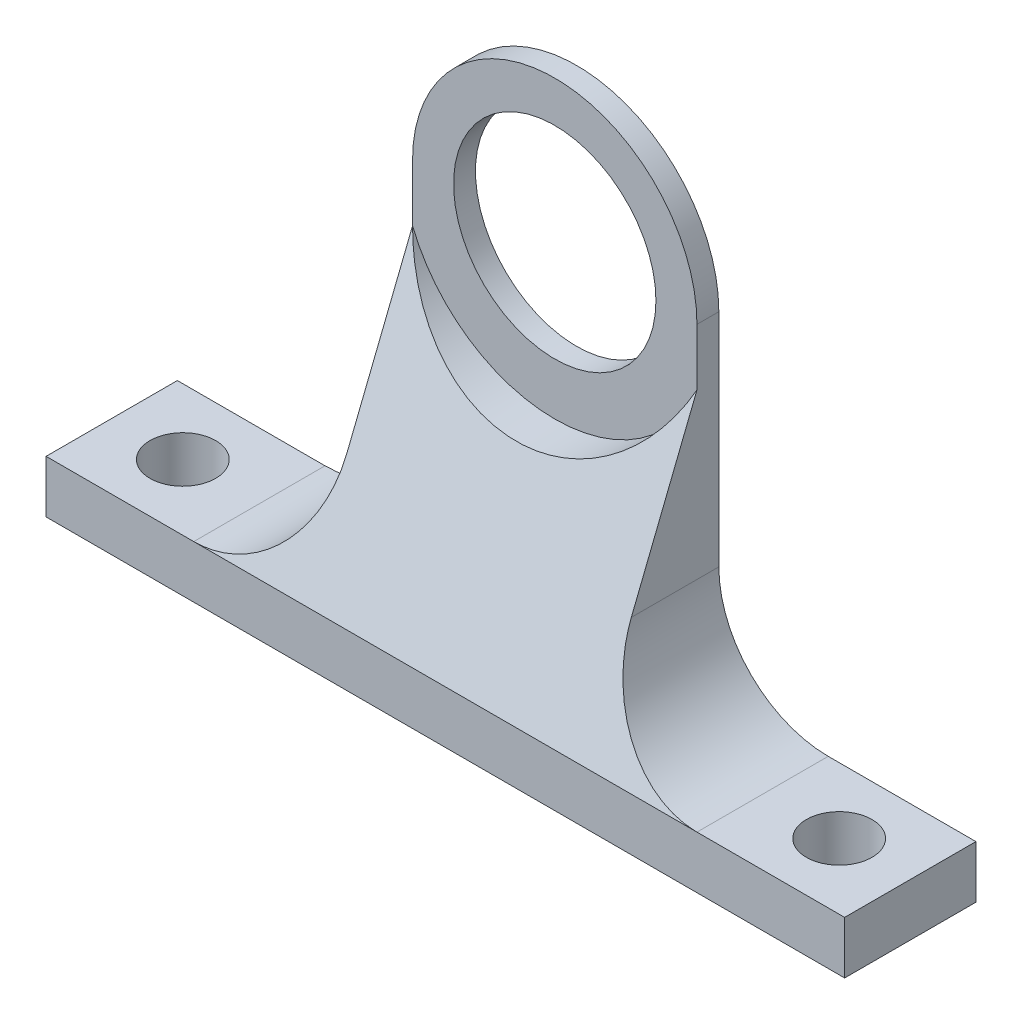
ISO-10303-21;
HEADER;
FILE_DESCRIPTION(('STEP AP214'),'2;1');
FILE_NAME('part.step','',(''),(''),'','','');
FILE_SCHEMA(('AUTOMOTIVE_DESIGN { 1 0 10303 214 1 1 1 1 }'));
ENDSEC;
DATA;
#1=APPLICATION_CONTEXT('core data for automotive mechanical design processes');
#2=APPLICATION_PROTOCOL_DEFINITION('international standard','automotive_design',2000,#1);
#3=PRODUCT_CONTEXT('',#1,'mechanical');
#4=PRODUCT('Part','Part','',(#3));
#5=PRODUCT_RELATED_PRODUCT_CATEGORY('part','',(#4));
#6=PRODUCT_DEFINITION_FORMATION('','',#4);
#7=PRODUCT_DEFINITION_CONTEXT('part definition',#1,'design');
#8=PRODUCT_DEFINITION('design','',#6,#7);
#9=PRODUCT_DEFINITION_SHAPE('','',#8);
#10=(LENGTH_UNIT() NAMED_UNIT(*) SI_UNIT(.MILLI.,.METRE.));
#11=(NAMED_UNIT(*) PLANE_ANGLE_UNIT() SI_UNIT($,.RADIAN.));
#12=(NAMED_UNIT(*) SI_UNIT($,.STERADIAN.) SOLID_ANGLE_UNIT());
#13=UNCERTAINTY_MEASURE_WITH_UNIT(LENGTH_MEASURE(1.E-05),#10,'distance_accuracy_value','');
#14=(GEOMETRIC_REPRESENTATION_CONTEXT(3) GLOBAL_UNCERTAINTY_ASSIGNED_CONTEXT((#13)) GLOBAL_UNIT_ASSIGNED_CONTEXT((#10,
#11,#12)) REPRESENTATION_CONTEXT('',''));
#15=CARTESIAN_POINT('',(0.,0.,0.));
#16=DIRECTION('',(0.,0.,1.));
#17=DIRECTION('',(1.,0.,0.));
#18=AXIS2_PLACEMENT_3D('',#15,#16,#17);
#19=CARTESIAN_POINT('',(0.,35.,12.));
#20=DIRECTION('',(0.,0.,-1.));
#21=DIRECTION('',(-1.,0.,0.));
#22=AXIS2_PLACEMENT_3D('',#19,#20,#21);
#23=CYLINDRICAL_SURFACE('',#22,13.);
#24=CARTESIAN_POINT('',(0.,35.,2.));
#25=DIRECTION('',(0.,0.,1.));
#26=DIRECTION('',(1.,0.,0.));
#27=AXIS2_PLACEMENT_3D('',#24,#25,#26);
#28=CIRCLE('',#27,13.);
#29=CARTESIAN_POINT('',(13.,35.,2.));
#30=VERTEX_POINT('',#29);
#31=CARTESIAN_POINT('',(-13.,35.,2.));
#32=VERTEX_POINT('',#31);
#33=EDGE_CURVE('E50',#30,#32,#28,.T.);
#34=ORIENTED_EDGE('',*,*,#33,.F.);
#35=DIRECTION('',(0.,0.,-1.));
#36=VECTOR('',#35,1.);
#37=CARTESIAN_POINT('',(13.,35.,12.));
#38=LINE('',#37,#36);
#39=CARTESIAN_POINT('',(13.,35.,0.));
#40=VERTEX_POINT('',#39);
#41=EDGE_CURVE('E217',#30,#40,#38,.T.);
#42=ORIENTED_EDGE('',*,*,#41,.T.);
#43=CARTESIAN_POINT('',(0.,35.,0.));
#44=DIRECTION('',(0.,0.,1.));
#45=DIRECTION('',(1.,0.,0.));
#46=AXIS2_PLACEMENT_3D('',#43,#44,#45);
#47=CIRCLE('',#46,13.);
#48=CARTESIAN_POINT('',(-13.,35.,0.));
#49=VERTEX_POINT('',#48);
#50=EDGE_CURVE('E203',#40,#49,#47,.T.);
#51=ORIENTED_EDGE('',*,*,#50,.T.);
#52=DIRECTION('',(0.,0.,-1.));
#53=VECTOR('',#52,1.);
#54=CARTESIAN_POINT('',(-13.,35.,12.));
#55=LINE('',#54,#53);
#56=EDGE_CURVE('E215',#32,#49,#55,.T.);
#57=ORIENTED_EDGE('',*,*,#56,.F.);
#58=EDGE_LOOP('',(#34,#42,#51,#57));
#59=FACE_BOUND('',#58,.T.);
#60=ADVANCED_FACE('F34',(#59),#23,.T.);
#61=CARTESIAN_POINT('',(0.,35.,12.));
#62=DIRECTION('',(0.,0.,-1.));
#63=DIRECTION('',(-1.,0.,0.));
#64=AXIS2_PLACEMENT_3D('',#61,#62,#63);
#65=CYLINDRICAL_SURFACE('',#64,9.25);
#66=CARTESIAN_POINT('',(0.,35.,0.));
#67=DIRECTION('',(0.,0.,1.));
#68=DIRECTION('',(1.,0.,0.));
#69=AXIS2_PLACEMENT_3D('',#66,#67,#68);
#70=CIRCLE('',#69,9.25);
#71=CARTESIAN_POINT('',(9.25,35.,0.));
#72=VERTEX_POINT('',#71);
#73=EDGE_CURVE('E173',#72,#72,#70,.T.);
#74=ORIENTED_EDGE('',*,*,#73,.F.);
#75=EDGE_LOOP('',(#74));
#76=FACE_BOUND('',#75,.T.);
#77=CARTESIAN_POINT('',(0.,35.,2.));
#78=DIRECTION('',(0.,0.,1.));
#79=DIRECTION('',(1.,0.,0.));
#80=AXIS2_PLACEMENT_3D('',#77,#78,#79);
#81=CIRCLE('',#80,9.25);
#82=CARTESIAN_POINT('',(9.25,35.,2.));
#83=VERTEX_POINT('',#82);
#84=EDGE_CURVE('E38',#83,#83,#81,.T.);
#85=ORIENTED_EDGE('',*,*,#84,.T.);
#86=EDGE_LOOP('',(#85));
#87=FACE_BOUND('',#86,.T.);
#88=ADVANCED_FACE('F263',(#76,#87),#65,.F.);
#89=CARTESIAN_POINT('',(-23.,14.8,12.));
#90=DIRECTION('',(0.,0.,1.));
#91=DIRECTION('',(1.,0.,0.));
#92=AXIS2_PLACEMENT_3D('',#89,#90,#91);
#93=PLANE('',#92);
#94=DIRECTION('',(-1.,0.,0.));
#95=VECTOR('',#94,1.);
#96=CARTESIAN_POINT('',(36.5,4.8,12.));
#97=LINE('',#96,#95);
#98=CARTESIAN_POINT('',(23.,4.8,12.));
#99=VERTEX_POINT('',#98);
#100=CARTESIAN_POINT('',(-23.0000000000001,4.8,12.));
#101=VERTEX_POINT('',#100);
#102=EDGE_CURVE('E138',#99,#101,#97,.T.);
#103=ORIENTED_EDGE('',*,*,#102,.T.);
#104=DIRECTION('',(-1.,0.,0.));
#105=VECTOR('',#104,1.);
#106=CARTESIAN_POINT('',(-36.5,4.8,12.));
#107=LINE('',#106,#105);
#108=CARTESIAN_POINT('',(-36.5,4.8,12.));
#109=VERTEX_POINT('',#108);
#110=EDGE_CURVE('E59',#101,#109,#107,.T.);
#111=ORIENTED_EDGE('',*,*,#110,.T.);
#112=DIRECTION('',(0.,-1.,0.));
#113=VECTOR('',#112,1.);
#114=CARTESIAN_POINT('',(-36.5,0.,12.));
#115=LINE('',#114,#113);
#116=CARTESIAN_POINT('',(-36.5,0.,12.));
#117=VERTEX_POINT('',#116);
#118=EDGE_CURVE('E179',#109,#117,#115,.T.);
#119=ORIENTED_EDGE('',*,*,#118,.T.);
#120=DIRECTION('',(1.,0.,0.));
#121=VECTOR('',#120,1.);
#122=CARTESIAN_POINT('',(-36.5,0.,12.));
#123=LINE('',#122,#121);
#124=CARTESIAN_POINT('',(36.5,0.,12.));
#125=VERTEX_POINT('',#124);
#126=EDGE_CURVE('E106',#117,#125,#123,.T.);
#127=ORIENTED_EDGE('',*,*,#126,.T.);
#128=DIRECTION('',(0.,1.,0.));
#129=VECTOR('',#128,1.);
#130=CARTESIAN_POINT('',(36.5,0.,12.));
#131=LINE('',#130,#129);
#132=CARTESIAN_POINT('',(36.5,4.8,12.));
#133=VERTEX_POINT('',#132);
#134=EDGE_CURVE('E182',#125,#133,#131,.T.);
#135=ORIENTED_EDGE('',*,*,#134,.T.);
#136=DIRECTION('',(-1.,0.,0.));
#137=VECTOR('',#136,1.);
#138=CARTESIAN_POINT('',(36.5,4.8,12.));
#139=LINE('',#138,#137);
#140=EDGE_CURVE('E184',#133,#99,#139,.T.);
#141=ORIENTED_EDGE('',*,*,#140,.T.);
#142=EDGE_LOOP('',(#103,#111,#119,#127,#135,#141));
#143=FACE_BOUND('',#142,.T.);
#144=ADVANCED_FACE('F248',(#143),#93,.T.);
#145=CARTESIAN_POINT('',(-23.,14.8,0.));
#146=DIRECTION('',(0.,0.,1.));
#147=DIRECTION('',(1.,0.,0.));
#148=AXIS2_PLACEMENT_3D('',#145,#146,#147);
#149=PLANE('',#148);
#150=DIRECTION('',(0.,-1.,0.));
#151=VECTOR('',#150,1.);
#152=CARTESIAN_POINT('',(-36.5,0.,0.));
#153=LINE('',#152,#151);
#154=CARTESIAN_POINT('',(-36.5,4.8,0.));
#155=VERTEX_POINT('',#154);
#156=CARTESIAN_POINT('',(-36.5,0.,0.));
#157=VERTEX_POINT('',#156);
#158=EDGE_CURVE('E178',#155,#157,#153,.T.);
#159=ORIENTED_EDGE('',*,*,#158,.F.);
#160=DIRECTION('',(-1.,0.,0.));
#161=VECTOR('',#160,1.);
#162=CARTESIAN_POINT('',(-36.5,4.8,0.));
#163=LINE('',#162,#161);
#164=CARTESIAN_POINT('',(-23.0000000000001,4.8,0.));
#165=VERTEX_POINT('',#164);
#166=EDGE_CURVE('E99',#165,#155,#163,.T.);
#167=ORIENTED_EDGE('',*,*,#166,.F.);
#168=CARTESIAN_POINT('',(-23.,14.8,0.));
#169=DIRECTION('',(0.,0.,-1.));
#170=DIRECTION('',(1.,0.,0.));
#171=AXIS2_PLACEMENT_3D('',#168,#169,#170);
#172=CIRCLE('',#171,10.);
#173=CARTESIAN_POINT('',(-13.,14.8000000000001,0.));
#174=VERTEX_POINT('',#173);
#175=EDGE_CURVE('E208',#174,#165,#172,.T.);
#176=ORIENTED_EDGE('',*,*,#175,.F.);
#177=DIRECTION('',(0.,-1.,0.));
#178=VECTOR('',#177,1.);
#179=CARTESIAN_POINT('',(-13.,14.8000000000001,0.));
#180=LINE('',#179,#178);
#181=EDGE_CURVE('E206',#49,#174,#180,.T.);
#182=ORIENTED_EDGE('',*,*,#181,.F.);
#183=ORIENTED_EDGE('',*,*,#50,.F.);
#184=DIRECTION('',(0.,1.,0.));
#185=VECTOR('',#184,1.);
#186=CARTESIAN_POINT('',(13.,14.8,0.));
#187=LINE('',#186,#185);
#188=CARTESIAN_POINT('',(13.,14.8,0.));
#189=VERTEX_POINT('',#188);
#190=EDGE_CURVE('E200',#189,#40,#187,.T.);
#191=ORIENTED_EDGE('',*,*,#190,.F.);
#192=CARTESIAN_POINT('',(23.,14.8,0.));
#193=DIRECTION('',(0.,0.,-1.));
#194=DIRECTION('',(-1.,0.,0.));
#195=AXIS2_PLACEMENT_3D('',#192,#193,#194);
#196=CIRCLE('',#195,10.);
#197=CARTESIAN_POINT('',(23.,4.8,0.));
#198=VERTEX_POINT('',#197);
#199=EDGE_CURVE('E197',#198,#189,#196,.T.);
#200=ORIENTED_EDGE('',*,*,#199,.F.);
#201=DIRECTION('',(-1.,0.,0.));
#202=VECTOR('',#201,1.);
#203=CARTESIAN_POINT('',(36.5,4.8,0.));
#204=LINE('',#203,#202);
#205=CARTESIAN_POINT('',(36.5,4.8,0.));
#206=VERTEX_POINT('',#205);
#207=EDGE_CURVE('E195',#206,#198,#204,.T.);
#208=ORIENTED_EDGE('',*,*,#207,.F.);
#209=DIRECTION('',(0.,1.,0.));
#210=VECTOR('',#209,1.);
#211=CARTESIAN_POINT('',(36.5,0.,0.));
#212=LINE('',#211,#210);
#213=CARTESIAN_POINT('',(36.5,0.,0.));
#214=VERTEX_POINT('',#213);
#215=EDGE_CURVE('E193',#214,#206,#212,.T.);
#216=ORIENTED_EDGE('',*,*,#215,.F.);
#217=DIRECTION('',(1.,0.,0.));
#218=VECTOR('',#217,1.);
#219=CARTESIAN_POINT('',(-36.5,0.,0.));
#220=LINE('',#219,#218);
#221=EDGE_CURVE('E191',#157,#214,#220,.T.);
#222=ORIENTED_EDGE('',*,*,#221,.F.);
#223=EDGE_LOOP('',(#159,#167,#176,#182,#183,#191,#200,#208,#216,#222));
#224=FACE_BOUND('',#223,.T.);
#225=ORIENTED_EDGE('',*,*,#73,.T.);
#226=EDGE_LOOP('',(#225));
#227=FACE_BOUND('',#226,.T.);
#228=ADVANCED_FACE('F236',(#224,#227),#149,.F.);
#229=CARTESIAN_POINT('',(-36.5,0.,12.));
#230=DIRECTION('',(1.,0.,0.));
#231=DIRECTION('',(0.,0.,-1.));
#232=AXIS2_PLACEMENT_3D('',#229,#230,#231);
#233=PLANE('',#232);
#234=ORIENTED_EDGE('',*,*,#158,.T.);
#235=DIRECTION('',(0.,0.,-1.));
#236=VECTOR('',#235,1.);
#237=CARTESIAN_POINT('',(-36.5,0.,12.));
#238=LINE('',#237,#236);
#239=EDGE_CURVE('E12',#117,#157,#238,.T.);
#240=ORIENTED_EDGE('',*,*,#239,.F.);
#241=ORIENTED_EDGE('',*,*,#118,.F.);
#242=DIRECTION('',(0.,0.,-1.));
#243=VECTOR('',#242,1.);
#244=CARTESIAN_POINT('',(-36.5,4.8,12.));
#245=LINE('',#244,#243);
#246=EDGE_CURVE('E188',#109,#155,#245,.T.);
#247=ORIENTED_EDGE('',*,*,#246,.T.);
#248=EDGE_LOOP('',(#234,#240,#241,#247));
#249=FACE_BOUND('',#248,.T.);
#250=ADVANCED_FACE('F36',(#249),#233,.F.);
#251=CARTESIAN_POINT('',(-36.5,0.,12.));
#252=DIRECTION('',(0.,1.,0.));
#253=DIRECTION('',(0.,0.,1.));
#254=AXIS2_PLACEMENT_3D('',#251,#252,#253);
#255=PLANE('',#254);
#256=CARTESIAN_POINT('',(30.,0.,5.99999999999998));
#257=DIRECTION('',(0.,1.,0.));
#258=DIRECTION('',(-1.,0.,0.));
#259=AXIS2_PLACEMENT_3D('',#256,#257,#258);
#260=CIRCLE('',#259,3.);
#261=CARTESIAN_POINT('',(27.,0.,5.99999999999998));
#262=VERTEX_POINT('',#261);
#263=EDGE_CURVE('E164',#262,#262,#260,.T.);
#264=ORIENTED_EDGE('',*,*,#263,.T.);
#265=EDGE_LOOP('',(#264));
#266=FACE_BOUND('',#265,.T.);
#267=CARTESIAN_POINT('',(-30.,0.,6.00000000000001));
#268=DIRECTION('',(0.,1.,0.));
#269=DIRECTION('',(-1.,0.,0.));
#270=AXIS2_PLACEMENT_3D('',#267,#268,#269);
#271=CIRCLE('',#270,3.);
#272=CARTESIAN_POINT('',(-33.,0.,6.00000000000001));
#273=VERTEX_POINT('',#272);
#274=EDGE_CURVE('E170',#273,#273,#271,.T.);
#275=ORIENTED_EDGE('',*,*,#274,.T.);
#276=EDGE_LOOP('',(#275));
#277=FACE_BOUND('',#276,.T.);
#278=ORIENTED_EDGE('',*,*,#221,.T.);
#279=DIRECTION('',(0.,0.,-1.));
#280=VECTOR('',#279,1.);
#281=CARTESIAN_POINT('',(36.5,0.,12.));
#282=LINE('',#281,#280);
#283=EDGE_CURVE('E43',#125,#214,#282,.T.);
#284=ORIENTED_EDGE('',*,*,#283,.F.);
#285=ORIENTED_EDGE('',*,*,#126,.F.);
#286=ORIENTED_EDGE('',*,*,#239,.T.);
#287=EDGE_LOOP('',(#278,#284,#285,#286));
#288=FACE_BOUND('',#287,.T.);
#289=ADVANCED_FACE('F253',(#266,#277,#288),#255,.F.);
#290=CARTESIAN_POINT('',(36.5,0.,12.));
#291=DIRECTION('',(-1.,0.,0.));
#292=DIRECTION('',(0.,0.,1.));
#293=AXIS2_PLACEMENT_3D('',#290,#291,#292);
#294=PLANE('',#293);
#295=ORIENTED_EDGE('',*,*,#215,.T.);
#296=DIRECTION('',(0.,0.,-1.));
#297=VECTOR('',#296,1.);
#298=CARTESIAN_POINT('',(36.5,4.8,12.));
#299=LINE('',#298,#297);
#300=EDGE_CURVE('E224',#133,#206,#299,.T.);
#301=ORIENTED_EDGE('',*,*,#300,.F.);
#302=ORIENTED_EDGE('',*,*,#134,.F.);
#303=ORIENTED_EDGE('',*,*,#283,.T.);
#304=EDGE_LOOP('',(#295,#301,#302,#303));
#305=FACE_BOUND('',#304,.T.);
#306=ADVANCED_FACE('F231',(#305),#294,.F.);
#307=CARTESIAN_POINT('',(36.5,4.8,12.));
#308=DIRECTION('',(0.,-1.,0.));
#309=DIRECTION('',(1.,0.,0.));
#310=AXIS2_PLACEMENT_3D('',#307,#308,#309);
#311=PLANE('',#310);
#312=CARTESIAN_POINT('',(30.,4.79999999999997,5.99999999999998));
#313=DIRECTION('',(0.,1.,0.));
#314=DIRECTION('',(-1.,0.,0.));
#315=AXIS2_PLACEMENT_3D('',#312,#313,#314);
#316=CIRCLE('',#315,3.);
#317=CARTESIAN_POINT('',(27.,4.79999999999997,5.99999999999998));
#318=VERTEX_POINT('',#317);
#319=EDGE_CURVE('E163',#318,#318,#316,.T.);
#320=ORIENTED_EDGE('',*,*,#319,.F.);
#321=EDGE_LOOP('',(#320));
#322=FACE_BOUND('',#321,.T.);
#323=ORIENTED_EDGE('',*,*,#207,.T.);
#324=DIRECTION('',(0.,0.,-1.));
#325=VECTOR('',#324,1.);
#326=CARTESIAN_POINT('',(23.,4.8,12.));
#327=LINE('',#326,#325);
#328=EDGE_CURVE('E221',#99,#198,#327,.T.);
#329=ORIENTED_EDGE('',*,*,#328,.F.);
#330=ORIENTED_EDGE('',*,*,#140,.F.);
#331=ORIENTED_EDGE('',*,*,#300,.T.);
#332=EDGE_LOOP('',(#323,#329,#330,#331));
#333=FACE_BOUND('',#332,.T.);
#334=ADVANCED_FACE('F242',(#322,#333),#311,.F.);
#335=CARTESIAN_POINT('',(23.,14.8,12.));
#336=DIRECTION('',(0.,0.,-1.));
#337=DIRECTION('',(-1.,0.,0.));
#338=AXIS2_PLACEMENT_3D('',#335,#336,#337);
#339=CYLINDRICAL_SURFACE('',#338,10.);
#340=DIRECTION('',(0.,0.,-1.));
#341=VECTOR('',#340,1.);
#342=CARTESIAN_POINT('',(13.,14.8,12.));
#343=LINE('',#342,#341);
#344=CARTESIAN_POINT('',(13.,14.8,8.00061551763687));
#345=VERTEX_POINT('',#344);
#346=EDGE_CURVE('E219',#345,#189,#343,.T.);
#347=ORIENTED_EDGE('',*,*,#346,.F.);
#348=CARTESIAN_POINT('',(23.,14.8,8.00061551763687));
#349=DIRECTION('',(0.,-0.371341408080561,-0.928496396678385));
#350=DIRECTION('',(0.,0.928496396678386,-0.371341408080561));
#351=AXIS2_PLACEMENT_3D('',#348,#349,#350);
#352=ELLIPSE('',#351,10.7701010319201,10.);
#353=EDGE_CURVE('E156',#345,#99,#352,.F.);
#354=ORIENTED_EDGE('',*,*,#353,.T.);
#355=ORIENTED_EDGE('',*,*,#328,.T.);
#356=ORIENTED_EDGE('',*,*,#199,.T.);
#357=EDGE_LOOP('',(#347,#354,#355,#356));
#358=FACE_BOUND('',#357,.T.);
#359=ADVANCED_FACE('F247',(#358),#339,.F.);
#360=CARTESIAN_POINT('',(13.,14.8,12.));
#361=DIRECTION('',(-1.,0.,0.));
#362=DIRECTION('',(0.,0.,1.));
#363=AXIS2_PLACEMENT_3D('',#360,#361,#362);
#364=PLANE('',#363);
#365=DIRECTION('',(0.,1.,0.));
#366=VECTOR('',#365,1.);
#367=CARTESIAN_POINT('',(13.,14.8,2.));
#368=LINE('',#367,#366);
#369=CARTESIAN_POINT('',(13.,29.8038475772934,2.));
#370=VERTEX_POINT('',#369);
#371=EDGE_CURVE('E161',#370,#30,#368,.T.);
#372=ORIENTED_EDGE('',*,*,#371,.F.);
#373=DIRECTION('',(0.,-0.928496396678386,0.371341408080561));
#374=VECTOR('',#373,1.);
#375=CARTESIAN_POINT('',(13.,13.4210555864475,8.5521084065972));
#376=LINE('',#375,#374);
#377=EDGE_CURVE('E134',#370,#345,#376,.T.);
#378=ORIENTED_EDGE('',*,*,#377,.T.);
#379=ORIENTED_EDGE('',*,*,#346,.T.);
#380=ORIENTED_EDGE('',*,*,#190,.T.);
#381=ORIENTED_EDGE('',*,*,#41,.F.);
#382=EDGE_LOOP('',(#372,#378,#379,#380,#381));
#383=FACE_BOUND('',#382,.T.);
#384=ADVANCED_FACE('F274',(#383),#364,.F.);
#385=CARTESIAN_POINT('',(-13.,14.8000000000001,12.));
#386=DIRECTION('',(1.,0.,0.));
#387=DIRECTION('',(0.,0.,-1.));
#388=AXIS2_PLACEMENT_3D('',#385,#386,#387);
#389=PLANE('',#388);
#390=DIRECTION('',(0.,0.,-1.));
#391=VECTOR('',#390,1.);
#392=CARTESIAN_POINT('',(-13.,14.8000000000001,12.));
#393=LINE('',#392,#391);
#394=CARTESIAN_POINT('',(-13.,14.8000000000001,8.00061551763684));
#395=VERTEX_POINT('',#394);
#396=EDGE_CURVE('E146',#395,#174,#393,.T.);
#397=ORIENTED_EDGE('',*,*,#396,.F.);
#398=DIRECTION('',(0.,0.928496396678386,-0.371341408080561));
#399=VECTOR('',#398,1.);
#400=CARTESIAN_POINT('',(-13.,13.4210555864475,8.55210840659718));
#401=LINE('',#400,#399);
#402=CARTESIAN_POINT('',(-13.,29.8038475772934,2.));
#403=VERTEX_POINT('',#402);
#404=EDGE_CURVE('E131',#395,#403,#401,.T.);
#405=ORIENTED_EDGE('',*,*,#404,.T.);
#406=DIRECTION('',(0.,-1.,0.));
#407=VECTOR('',#406,1.);
#408=CARTESIAN_POINT('',(-13.,14.8000000000001,2.));
#409=LINE('',#408,#407);
#410=EDGE_CURVE('E143',#32,#403,#409,.T.);
#411=ORIENTED_EDGE('',*,*,#410,.F.);
#412=ORIENTED_EDGE('',*,*,#56,.T.);
#413=ORIENTED_EDGE('',*,*,#181,.T.);
#414=EDGE_LOOP('',(#397,#405,#411,#412,#413));
#415=FACE_BOUND('',#414,.T.);
#416=ADVANCED_FACE('F142',(#415),#389,.F.);
#417=CARTESIAN_POINT('',(-23.,14.8,12.));
#418=DIRECTION('',(0.,0.,-1.));
#419=DIRECTION('',(-1.,0.,0.));
#420=AXIS2_PLACEMENT_3D('',#417,#418,#419);
#421=CYLINDRICAL_SURFACE('',#420,10.);
#422=DIRECTION('',(0.,0.,-1.));
#423=VECTOR('',#422,1.);
#424=CARTESIAN_POINT('',(-23.0000000000001,4.8,12.));
#425=LINE('',#424,#423);
#426=EDGE_CURVE('E212',#101,#165,#425,.T.);
#427=ORIENTED_EDGE('',*,*,#426,.F.);
#428=CARTESIAN_POINT('',(-23.,14.8,8.00061551763687));
#429=DIRECTION('',(0.,-0.371341408080561,-0.928496396678385));
#430=DIRECTION('',(0.,0.928496396678386,-0.371341408080561));
#431=AXIS2_PLACEMENT_3D('',#428,#429,#430);
#432=ELLIPSE('',#431,10.7701010319201,10.);
#433=EDGE_CURVE('E153',#101,#395,#432,.F.);
#434=ORIENTED_EDGE('',*,*,#433,.T.);
#435=ORIENTED_EDGE('',*,*,#396,.T.);
#436=ORIENTED_EDGE('',*,*,#175,.T.);
#437=EDGE_LOOP('',(#427,#434,#435,#436));
#438=FACE_BOUND('',#437,.T.);
#439=ADVANCED_FACE('F307',(#438),#421,.F.);
#440=CARTESIAN_POINT('',(-36.5,4.8,12.));
#441=DIRECTION('',(0.,-1.,0.));
#442=DIRECTION('',(1.,0.,0.));
#443=AXIS2_PLACEMENT_3D('',#440,#441,#442);
#444=PLANE('',#443);
#445=CARTESIAN_POINT('',(-30.,4.8,6.00000000000001));
#446=DIRECTION('',(0.,1.,0.));
#447=DIRECTION('',(-1.,0.,0.));
#448=AXIS2_PLACEMENT_3D('',#445,#446,#447);
#449=CIRCLE('',#448,3.);
#450=CARTESIAN_POINT('',(-33.,4.8,6.00000000000001));
#451=VERTEX_POINT('',#450);
#452=EDGE_CURVE('E167',#451,#451,#449,.T.);
#453=ORIENTED_EDGE('',*,*,#452,.F.);
#454=EDGE_LOOP('',(#453));
#455=FACE_BOUND('',#454,.T.);
#456=ORIENTED_EDGE('',*,*,#166,.T.);
#457=ORIENTED_EDGE('',*,*,#246,.F.);
#458=ORIENTED_EDGE('',*,*,#110,.F.);
#459=ORIENTED_EDGE('',*,*,#426,.T.);
#460=EDGE_LOOP('',(#456,#457,#458,#459));
#461=FACE_BOUND('',#460,.T.);
#462=ADVANCED_FACE('F296',(#455,#461),#444,.F.);
#463=CARTESIAN_POINT('',(-30.,0.,6.00000000000001));
#464=DIRECTION('',(0.,1.,0.));
#465=DIRECTION('',(-1.,0.,0.));
#466=AXIS2_PLACEMENT_3D('',#463,#464,#465);
#467=CYLINDRICAL_SURFACE('',#466,3.);
#468=ORIENTED_EDGE('',*,*,#274,.F.);
#469=EDGE_LOOP('',(#468));
#470=FACE_BOUND('',#469,.T.);
#471=ORIENTED_EDGE('',*,*,#452,.T.);
#472=EDGE_LOOP('',(#471));
#473=FACE_BOUND('',#472,.T.);
#474=ADVANCED_FACE('F288',(#470,#473),#467,.F.);
#475=CARTESIAN_POINT('',(30.,0.,5.99999999999998));
#476=DIRECTION('',(0.,1.,0.));
#477=DIRECTION('',(-1.,0.,0.));
#478=AXIS2_PLACEMENT_3D('',#475,#476,#477);
#479=CYLINDRICAL_SURFACE('',#478,3.);
#480=ORIENTED_EDGE('',*,*,#263,.F.);
#481=EDGE_LOOP('',(#480));
#482=FACE_BOUND('',#481,.T.);
#483=ORIENTED_EDGE('',*,*,#319,.T.);
#484=EDGE_LOOP('',(#483));
#485=FACE_BOUND('',#484,.T.);
#486=ADVANCED_FACE('F286',(#482,#485),#479,.F.);
#487=CARTESIAN_POINT('',(0.,35.,-39.5979797464467));
#488=DIRECTION('',(0.,0.,1.));
#489=DIRECTION('',(1.,0.,0.));
#490=AXIS2_PLACEMENT_3D('',#487,#488,#489);
#491=CYLINDRICAL_SURFACE('',#490,14.);
#492=CARTESIAN_POINT('',(0.,35.,2.));
#493=DIRECTION('',(0.,0.,1.));
#494=DIRECTION('',(1.,0.,0.));
#495=AXIS2_PLACEMENT_3D('',#492,#493,#494);
#496=CIRCLE('',#495,14.);
#497=EDGE_CURVE('E149',#370,#403,#496,.F.);
#498=ORIENTED_EDGE('',*,*,#497,.T.);
#499=CARTESIAN_POINT('',(0.,35.,-0.0781411367366536));
#500=DIRECTION('',(0.,-0.371341408080561,-0.928496396678385));
#501=DIRECTION('',(0.,-0.928496396678386,0.371341408080561));
#502=AXIS2_PLACEMENT_3D('',#499,#500,#501);
#503=ELLIPSE('',#502,15.0781414446882,14.);
#504=EDGE_CURVE('E128',#403,#370,#503,.F.);
#505=ORIENTED_EDGE('',*,*,#504,.T.);
#506=EDGE_LOOP('',(#498,#505));
#507=FACE_BOUND('',#506,.T.);
#508=ADVANCED_FACE('F152',(#507),#491,.F.);
#509=CARTESIAN_POINT('',(-23.,14.8,2.));
#510=DIRECTION('',(0.,0.,1.));
#511=DIRECTION('',(1.,0.,0.));
#512=AXIS2_PLACEMENT_3D('',#509,#510,#511);
#513=PLANE('',#512);
#514=ORIENTED_EDGE('',*,*,#84,.F.);
#515=EDGE_LOOP('',(#514));
#516=FACE_BOUND('',#515,.T.);
#517=ORIENTED_EDGE('',*,*,#410,.T.);
#518=ORIENTED_EDGE('',*,*,#497,.F.);
#519=ORIENTED_EDGE('',*,*,#371,.T.);
#520=ORIENTED_EDGE('',*,*,#33,.T.);
#521=EDGE_LOOP('',(#517,#518,#519,#520));
#522=FACE_BOUND('',#521,.T.);
#523=ADVANCED_FACE('F148',(#516,#522),#513,.T.);
#524=CARTESIAN_POINT('',(36.5,29.8038475772934,2.));
#525=DIRECTION('',(0.,-0.371341408080561,-0.928496396678385));
#526=DIRECTION('',(0.,0.928496396678386,-0.371341408080561));
#527=AXIS2_PLACEMENT_3D('',#524,#525,#526);
#528=PLANE('',#527);
#529=ORIENTED_EDGE('',*,*,#102,.F.);
#530=ORIENTED_EDGE('',*,*,#353,.F.);
#531=ORIENTED_EDGE('',*,*,#377,.F.);
#532=ORIENTED_EDGE('',*,*,#504,.F.);
#533=ORIENTED_EDGE('',*,*,#404,.F.);
#534=ORIENTED_EDGE('',*,*,#433,.F.);
#535=EDGE_LOOP('',(#529,#530,#531,#532,#533,#534));
#536=FACE_BOUND('',#535,.T.);
#537=ADVANCED_FACE('F130',(#536),#528,.F.);
#538=CLOSED_SHELL('',(#60,#88,#144,#228,#250,#289,#306,#334,#359,#384,#416,#439,#462,#474,#486,
#508,#523,#537));
#539=MANIFOLD_SOLID_BREP('B2',#538);
#540=ADVANCED_BREP_SHAPE_REPRESENTATION('',(#18,#539),#14);
#541=SHAPE_DEFINITION_REPRESENTATION(#9,#540);
ENDSEC;
END-ISO-10303-21;
